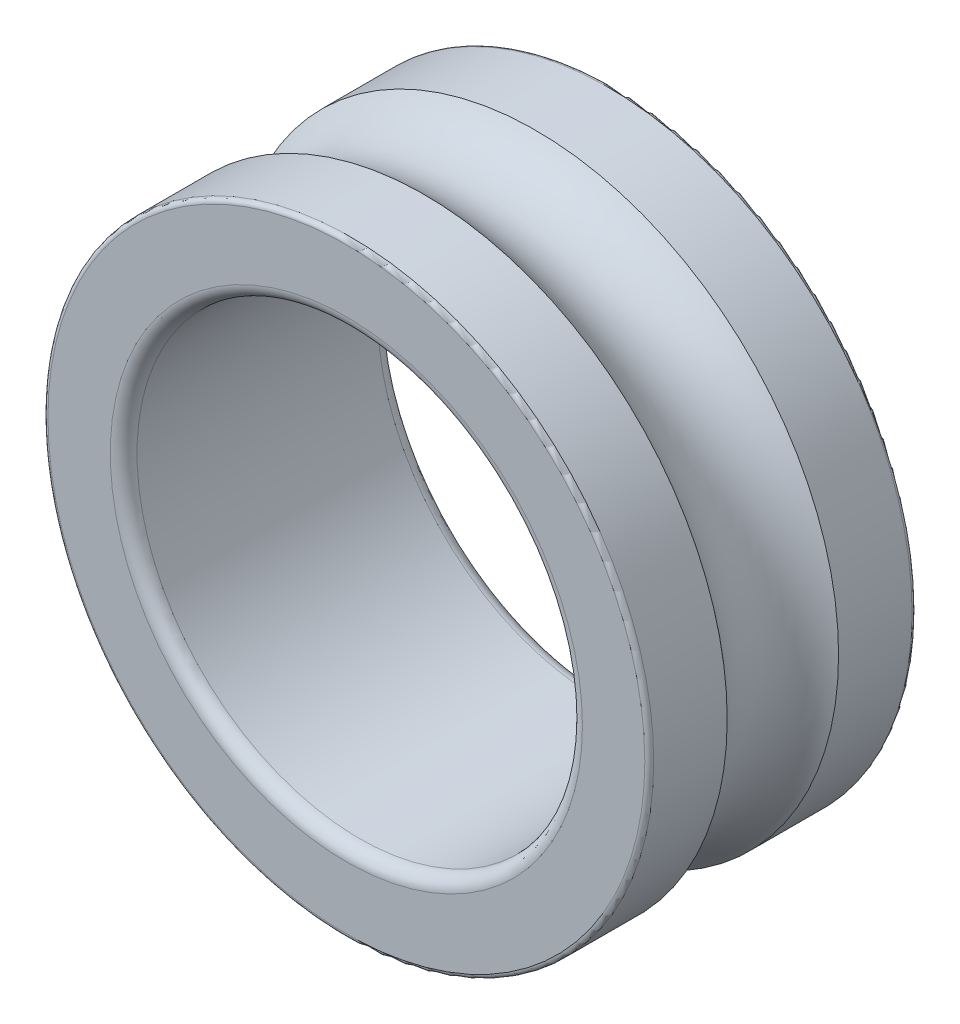
ISO-10303-21;
HEADER;
FILE_DESCRIPTION(('STEP AP214'),'2;1');
FILE_NAME('part.step','',(''),(''),'','','');
FILE_SCHEMA(('AUTOMOTIVE_DESIGN { 1 0 10303 214 1 1 1 1 }'));
ENDSEC;
DATA;
#1=APPLICATION_CONTEXT('core data for automotive mechanical design processes');
#2=APPLICATION_PROTOCOL_DEFINITION('international standard','automotive_design',2000,#1);
#3=PRODUCT_CONTEXT('',#1,'mechanical');
#4=PRODUCT('Part','Part','',(#3));
#5=PRODUCT_RELATED_PRODUCT_CATEGORY('part','',(#4));
#6=PRODUCT_DEFINITION_FORMATION('','',#4);
#7=PRODUCT_DEFINITION_CONTEXT('part definition',#1,'design');
#8=PRODUCT_DEFINITION('design','',#6,#7);
#9=PRODUCT_DEFINITION_SHAPE('','',#8);
#10=(LENGTH_UNIT() NAMED_UNIT(*) SI_UNIT(.MILLI.,.METRE.));
#11=(NAMED_UNIT(*) PLANE_ANGLE_UNIT() SI_UNIT($,.RADIAN.));
#12=(NAMED_UNIT(*) SI_UNIT($,.STERADIAN.) SOLID_ANGLE_UNIT());
#13=UNCERTAINTY_MEASURE_WITH_UNIT(LENGTH_MEASURE(1.E-05),#10,'distance_accuracy_value','');
#14=(GEOMETRIC_REPRESENTATION_CONTEXT(3) GLOBAL_UNCERTAINTY_ASSIGNED_CONTEXT((#13)) GLOBAL_UNIT_ASSIGNED_CONTEXT((#10,
#11,#12)) REPRESENTATION_CONTEXT('',''));
#15=CARTESIAN_POINT('',(0.,0.,0.));
#16=DIRECTION('',(0.,0.,1.));
#17=DIRECTION('',(1.,0.,0.));
#18=AXIS2_PLACEMENT_3D('',#15,#16,#17);
#19=CARTESIAN_POINT('',(0.,0.,6.));
#20=DIRECTION('',(0.,0.,1.));
#21=DIRECTION('',(1.,0.,0.));
#22=AXIS2_PLACEMENT_3D('',#19,#20,#21);
#23=PLANE('',#22);
#24=CARTESIAN_POINT('',(0.,-6.75,6.));
#25=DIRECTION('',(0.,0.,1.));
#26=DIRECTION('',(1.,0.,0.));
#27=AXIS2_PLACEMENT_3D('',#24,#25,#26);
#28=CIRCLE('',#27,10.6);
#29=CARTESIAN_POINT('',(10.6,-6.75,6.));
#30=VERTEX_POINT('',#29);
#31=EDGE_CURVE('E10',#30,#30,#28,.F.);
#32=ORIENTED_EDGE('',*,*,#31,.T.);
#33=EDGE_LOOP('',(#32));
#34=FACE_BOUND('',#33,.T.);
#35=CARTESIAN_POINT('',(0.,-6.75,6.));
#36=DIRECTION('',(0.,0.,1.));
#37=DIRECTION('',(1.,0.,0.));
#38=AXIS2_PLACEMENT_3D('',#35,#36,#37);
#39=CIRCLE('',#38,13.4);
#40=CARTESIAN_POINT('',(13.4,-6.75,6.));
#41=VERTEX_POINT('',#40);
#42=EDGE_CURVE('E71',#41,#41,#39,.T.);
#43=ORIENTED_EDGE('',*,*,#42,.T.);
#44=EDGE_LOOP('',(#43));
#45=FACE_BOUND('',#44,.T.);
#46=ADVANCED_FACE('F43',(#34,#45),#23,.T.);
#47=CARTESIAN_POINT('',(0.,-6.75,6.));
#48=DIRECTION('',(0.,0.,1.));
#49=DIRECTION('',(1.,0.,0.));
#50=AXIS2_PLACEMENT_3D('',#47,#48,#49);
#51=CYLINDRICAL_SURFACE('',#50,10.);
#52=CARTESIAN_POINT('',(0.,-6.75,-5.4));
#53=DIRECTION('',(0.,0.,1.));
#54=DIRECTION('',(1.,0.,0.));
#55=AXIS2_PLACEMENT_3D('',#52,#53,#54);
#56=CIRCLE('',#55,10.);
#57=CARTESIAN_POINT('',(10.,-6.75,-5.4));
#58=VERTEX_POINT('',#57);
#59=EDGE_CURVE('E51',#58,#58,#56,.F.);
#60=ORIENTED_EDGE('',*,*,#59,.T.);
#61=EDGE_LOOP('',(#60));
#62=FACE_BOUND('',#61,.T.);
#63=CARTESIAN_POINT('',(0.,-6.75,5.4));
#64=DIRECTION('',(0.,0.,1.));
#65=DIRECTION('',(1.,0.,0.));
#66=AXIS2_PLACEMENT_3D('',#63,#64,#65);
#67=CIRCLE('',#66,10.);
#68=CARTESIAN_POINT('',(10.,-6.75,5.4));
#69=VERTEX_POINT('',#68);
#70=EDGE_CURVE('E56',#69,#69,#67,.T.);
#71=ORIENTED_EDGE('',*,*,#70,.T.);
#72=EDGE_LOOP('',(#71));
#73=FACE_BOUND('',#72,.T.);
#74=ADVANCED_FACE('F110',(#62,#73),#51,.F.);
#75=CARTESIAN_POINT('',(0.,0.,-6.));
#76=DIRECTION('',(0.,0.,1.));
#77=DIRECTION('',(1.,0.,0.));
#78=AXIS2_PLACEMENT_3D('',#75,#76,#77);
#79=PLANE('',#78);
#80=CARTESIAN_POINT('',(0.,-6.75,-6.));
#81=DIRECTION('',(0.,0.,1.));
#82=DIRECTION('',(1.,0.,0.));
#83=AXIS2_PLACEMENT_3D('',#80,#81,#82);
#84=CIRCLE('',#83,10.6);
#85=CARTESIAN_POINT('',(10.6,-6.75,-6.));
#86=VERTEX_POINT('',#85);
#87=EDGE_CURVE('E61',#86,#86,#84,.T.);
#88=ORIENTED_EDGE('',*,*,#87,.T.);
#89=EDGE_LOOP('',(#88));
#90=FACE_BOUND('',#89,.T.);
#91=CARTESIAN_POINT('',(0.,-6.75,-6.));
#92=DIRECTION('',(0.,0.,1.));
#93=DIRECTION('',(1.,0.,0.));
#94=AXIS2_PLACEMENT_3D('',#91,#92,#93);
#95=CIRCLE('',#94,13.4);
#96=CARTESIAN_POINT('',(13.4,-6.75,-6.));
#97=VERTEX_POINT('',#96);
#98=EDGE_CURVE('E75',#97,#97,#95,.F.);
#99=ORIENTED_EDGE('',*,*,#98,.T.);
#100=EDGE_LOOP('',(#99));
#101=FACE_BOUND('',#100,.T.);
#102=ADVANCED_FACE('F106',(#90,#101),#79,.F.);
#103=CARTESIAN_POINT('',(0.,-6.75,6.));
#104=DIRECTION('',(0.,0.,1.));
#105=DIRECTION('',(1.,0.,0.));
#106=AXIS2_PLACEMENT_3D('',#103,#104,#105);
#107=CYLINDRICAL_SURFACE('',#106,13.6);
#108=CARTESIAN_POINT('',(0.,-6.75,-5.8));
#109=DIRECTION('',(0.,0.,1.));
#110=DIRECTION('',(1.,0.,0.));
#111=AXIS2_PLACEMENT_3D('',#108,#109,#110);
#112=CIRCLE('',#111,13.6);
#113=CARTESIAN_POINT('',(13.6,-6.75,-5.8));
#114=VERTEX_POINT('',#113);
#115=EDGE_CURVE('E79',#114,#114,#112,.T.);
#116=ORIENTED_EDGE('',*,*,#115,.T.);
#117=EDGE_LOOP('',(#116));
#118=FACE_BOUND('',#117,.T.);
#119=CARTESIAN_POINT('',(0.,-6.75,-2.5));
#120=DIRECTION('',(0.,0.,1.));
#121=DIRECTION('',(1.,0.,0.));
#122=AXIS2_PLACEMENT_3D('',#119,#120,#121);
#123=CIRCLE('',#122,13.6);
#124=CARTESIAN_POINT('',(13.6,-6.75,-2.5));
#125=VERTEX_POINT('',#124);
#126=EDGE_CURVE('E83',#125,#125,#123,.T.);
#127=ORIENTED_EDGE('',*,*,#126,.F.);
#128=EDGE_LOOP('',(#127));
#129=FACE_BOUND('',#128,.T.);
#130=ADVANCED_FACE('F96',(#118,#129),#107,.T.);
#131=CARTESIAN_POINT('',(0.,-6.75,0.));
#132=DIRECTION('',(0.,0.,1.));
#133=DIRECTION('',(1.,0.,0.));
#134=AXIS2_PLACEMENT_3D('',#131,#132,#133);
#135=TOROIDAL_SURFACE('',#134,15.5974984355438,3.2);
#136=ORIENTED_EDGE('',*,*,#126,.T.);
#137=EDGE_LOOP('',(#136));
#138=FACE_BOUND('',#137,.T.);
#139=CARTESIAN_POINT('',(0.,-6.75,2.5));
#140=DIRECTION('',(0.,0.,1.));
#141=DIRECTION('',(1.,0.,0.));
#142=AXIS2_PLACEMENT_3D('',#139,#140,#141);
#143=CIRCLE('',#142,13.6);
#144=CARTESIAN_POINT('',(13.6,-6.75,2.5));
#145=VERTEX_POINT('',#144);
#146=EDGE_CURVE('E87',#145,#145,#143,.T.);
#147=ORIENTED_EDGE('',*,*,#146,.F.);
#148=EDGE_LOOP('',(#147));
#149=FACE_BOUND('',#148,.T.);
#150=ADVANCED_FACE('F94',(#138,#149),#135,.F.);
#151=CARTESIAN_POINT('',(0.,-6.75,6.));
#152=DIRECTION('',(0.,0.,1.));
#153=DIRECTION('',(1.,0.,0.));
#154=AXIS2_PLACEMENT_3D('',#151,#152,#153);
#155=CYLINDRICAL_SURFACE('',#154,13.6);
#156=CARTESIAN_POINT('',(0.,-6.75,5.8));
#157=DIRECTION('',(0.,0.,1.));
#158=DIRECTION('',(1.,0.,0.));
#159=AXIS2_PLACEMENT_3D('',#156,#157,#158);
#160=CIRCLE('',#159,13.6);
#161=CARTESIAN_POINT('',(13.6,-6.75,5.8));
#162=VERTEX_POINT('',#161);
#163=EDGE_CURVE('E67',#162,#162,#160,.F.);
#164=ORIENTED_EDGE('',*,*,#163,.T.);
#165=EDGE_LOOP('',(#164));
#166=FACE_BOUND('',#165,.T.);
#167=ORIENTED_EDGE('',*,*,#146,.T.);
#168=EDGE_LOOP('',(#167));
#169=FACE_BOUND('',#168,.T.);
#170=ADVANCED_FACE('F92',(#166,#169),#155,.T.);
#171=CARTESIAN_POINT('',(0.,-6.75,-5.8));
#172=DIRECTION('',(0.,0.,1.));
#173=DIRECTION('',(1.,0.,0.));
#174=AXIS2_PLACEMENT_3D('',#171,#172,#173);
#175=TOROIDAL_SURFACE('',#174,13.4,0.2);
#176=ORIENTED_EDGE('',*,*,#98,.F.);
#177=EDGE_LOOP('',(#176));
#178=FACE_BOUND('',#177,.T.);
#179=ORIENTED_EDGE('',*,*,#115,.F.);
#180=EDGE_LOOP('',(#179));
#181=FACE_BOUND('',#180,.T.);
#182=ADVANCED_FACE('F103',(#178,#181),#175,.T.);
#183=CARTESIAN_POINT('',(0.,-6.75,5.8));
#184=DIRECTION('',(0.,0.,1.));
#185=DIRECTION('',(1.,0.,0.));
#186=AXIS2_PLACEMENT_3D('',#183,#184,#185);
#187=TOROIDAL_SURFACE('',#186,13.4,0.2);
#188=ORIENTED_EDGE('',*,*,#163,.F.);
#189=EDGE_LOOP('',(#188));
#190=FACE_BOUND('',#189,.T.);
#191=ORIENTED_EDGE('',*,*,#42,.F.);
#192=EDGE_LOOP('',(#191));
#193=FACE_BOUND('',#192,.T.);
#194=ADVANCED_FACE('F121',(#190,#193),#187,.T.);
#195=CARTESIAN_POINT('',(0.,-6.75,-5.4));
#196=DIRECTION('',(0.,0.,1.));
#197=DIRECTION('',(1.,0.,0.));
#198=AXIS2_PLACEMENT_3D('',#195,#196,#197);
#199=TOROIDAL_SURFACE('',#198,10.6,0.6);
#200=ORIENTED_EDGE('',*,*,#59,.F.);
#201=EDGE_LOOP('',(#200));
#202=FACE_BOUND('',#201,.T.);
#203=ORIENTED_EDGE('',*,*,#87,.F.);
#204=EDGE_LOOP('',(#203));
#205=FACE_BOUND('',#204,.T.);
#206=ADVANCED_FACE('F124',(#202,#205),#199,.T.);
#207=CARTESIAN_POINT('',(0.,-6.75,5.4));
#208=DIRECTION('',(0.,0.,1.));
#209=DIRECTION('',(1.,0.,0.));
#210=AXIS2_PLACEMENT_3D('',#207,#208,#209);
#211=TOROIDAL_SURFACE('',#210,10.6,0.6);
#212=ORIENTED_EDGE('',*,*,#31,.F.);
#213=EDGE_LOOP('',(#212));
#214=FACE_BOUND('',#213,.T.);
#215=ORIENTED_EDGE('',*,*,#70,.F.);
#216=EDGE_LOOP('',(#215));
#217=FACE_BOUND('',#216,.T.);
#218=ADVANCED_FACE('F45',(#214,#217),#211,.T.);
#219=CLOSED_SHELL('',(#46,#74,#102,#130,#150,#170,#182,#194,#206,#218));
#220=MANIFOLD_SOLID_BREP('B2',#219);
#221=ADVANCED_BREP_SHAPE_REPRESENTATION('',(#18,#220),#14);
#222=SHAPE_DEFINITION_REPRESENTATION(#9,#221);
ENDSEC;
END-ISO-10303-21;
